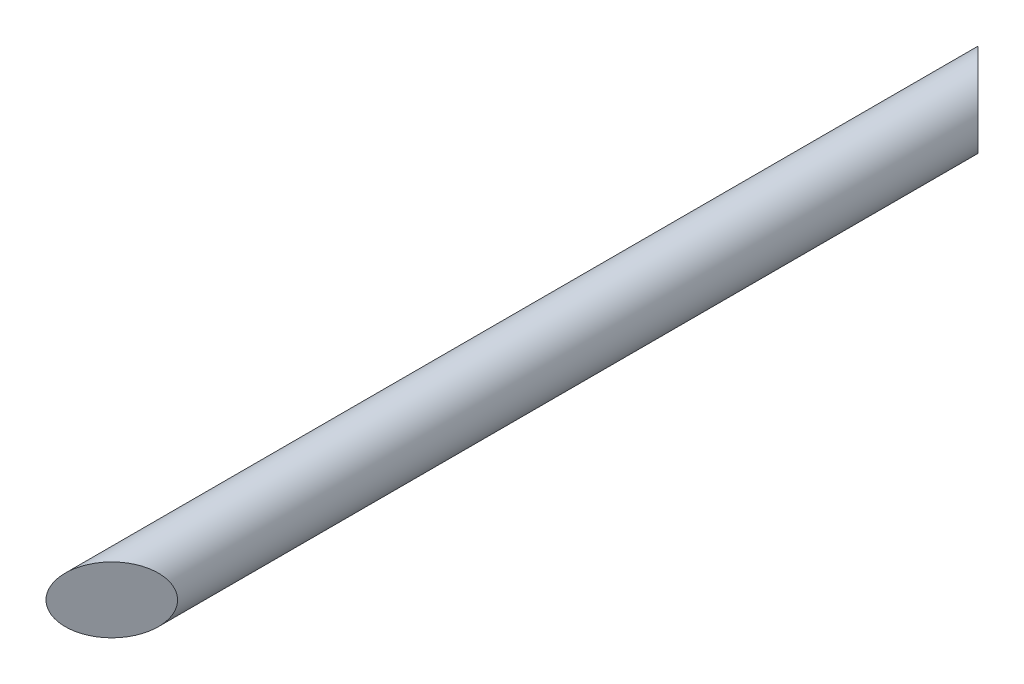
ISO-10303-21;
HEADER;
FILE_DESCRIPTION(('STEP AP214'),'2;1');
FILE_NAME('part.step','',(''),(''),'','','');
FILE_SCHEMA(('AUTOMOTIVE_DESIGN { 1 0 10303 214 1 1 1 1 }'));
ENDSEC;
DATA;
#1=APPLICATION_CONTEXT('core data for automotive mechanical design processes');
#2=APPLICATION_PROTOCOL_DEFINITION('international standard','automotive_design',2000,#1);
#3=PRODUCT_CONTEXT('',#1,'mechanical');
#4=PRODUCT('Part','Part','',(#3));
#5=PRODUCT_RELATED_PRODUCT_CATEGORY('part','',(#4));
#6=PRODUCT_DEFINITION_FORMATION('','',#4);
#7=PRODUCT_DEFINITION_CONTEXT('part definition',#1,'design');
#8=PRODUCT_DEFINITION('design','',#6,#7);
#9=PRODUCT_DEFINITION_SHAPE('','',#8);
#10=(LENGTH_UNIT() NAMED_UNIT(*) SI_UNIT(.MILLI.,.METRE.));
#11=(NAMED_UNIT(*) PLANE_ANGLE_UNIT() SI_UNIT($,.RADIAN.));
#12=(NAMED_UNIT(*) SI_UNIT($,.STERADIAN.) SOLID_ANGLE_UNIT());
#13=UNCERTAINTY_MEASURE_WITH_UNIT(LENGTH_MEASURE(1.E-05),#10,'distance_accuracy_value','');
#14=(GEOMETRIC_REPRESENTATION_CONTEXT(3) GLOBAL_UNCERTAINTY_ASSIGNED_CONTEXT((#13)) GLOBAL_UNIT_ASSIGNED_CONTEXT((#10,
#11,#12)) REPRESENTATION_CONTEXT('',''));
#15=CARTESIAN_POINT('',(0.,0.,0.));
#16=DIRECTION('',(0.,0.,1.));
#17=DIRECTION('',(1.,0.,0.));
#18=AXIS2_PLACEMENT_3D('',#15,#16,#17);
#19=CARTESIAN_POINT('',(0.,0.,850.));
#20=DIRECTION('',(0.,0.,-1.));
#21=DIRECTION('',(-1.,0.,0.));
#22=AXIS2_PLACEMENT_3D('',#19,#20,#21);
#23=CYLINDRICAL_SURFACE('',#22,30.);
#24=CARTESIAN_POINT('',(0.,0.,820.));
#25=DIRECTION('',(-0.707106781186547,0.,-0.707106781186548));
#26=DIRECTION('',(0.707106781186548,0.,-0.707106781186547));
#27=AXIS2_PLACEMENT_3D('',#24,#25,#26);
#28=ELLIPSE('',#27,42.4264068711928,30.);
#29=CARTESIAN_POINT('',(30.,0.,790.));
#30=VERTEX_POINT('',#29);
#31=EDGE_CURVE('E43',#30,#30,#28,.T.);
#32=ORIENTED_EDGE('',*,*,#31,.T.);
#33=EDGE_LOOP('',(#32));
#34=FACE_BOUND('',#33,.T.);
#35=CARTESIAN_POINT('',(0.,0.,29.9999999999999));
#36=DIRECTION('',(-0.707106781186548,0.,0.707106781186548));
#37=DIRECTION('',(-0.707106781186547,0.,-0.707106781186548));
#38=AXIS2_PLACEMENT_3D('',#35,#36,#37);
#39=ELLIPSE('',#38,42.4264068711928,30.);
#40=CARTESIAN_POINT('',(-30.,0.,0.));
#41=VERTEX_POINT('',#40);
#42=EDGE_CURVE('E10',#41,#41,#39,.T.);
#43=ORIENTED_EDGE('',*,*,#42,.T.);
#44=EDGE_LOOP('',(#43));
#45=FACE_BOUND('',#44,.T.);
#46=ADVANCED_FACE('F40',(#34,#45),#23,.T.);
#47=CARTESIAN_POINT('',(30.,-30.,790.));
#48=DIRECTION('',(-0.707106781186547,0.,-0.707106781186548));
#49=DIRECTION('',(-0.707106781186548,0.,0.707106781186547));
#50=AXIS2_PLACEMENT_3D('',#47,#48,#49);
#51=PLANE('',#50);
#52=ORIENTED_EDGE('',*,*,#31,.F.);
#53=EDGE_LOOP('',(#52));
#54=FACE_BOUND('',#53,.T.);
#55=ADVANCED_FACE('F49',(#54),#51,.F.);
#56=CARTESIAN_POINT('',(-30.,-30.,0.));
#57=DIRECTION('',(-0.707106781186548,0.,0.707106781186548));
#58=DIRECTION('',(0.707106781186547,0.,0.707106781186548));
#59=AXIS2_PLACEMENT_3D('',#56,#57,#58);
#60=PLANE('',#59);
#61=ORIENTED_EDGE('',*,*,#42,.F.);
#62=EDGE_LOOP('',(#61));
#63=FACE_BOUND('',#62,.T.);
#64=ADVANCED_FACE('F55',(#63),#60,.F.);
#65=CLOSED_SHELL('',(#46,#55,#64));
#66=MANIFOLD_SOLID_BREP('B2',#65);
#67=ADVANCED_BREP_SHAPE_REPRESENTATION('',(#18,#66),#14);
#68=SHAPE_DEFINITION_REPRESENTATION(#9,#67);
ENDSEC;
END-ISO-10303-21;
